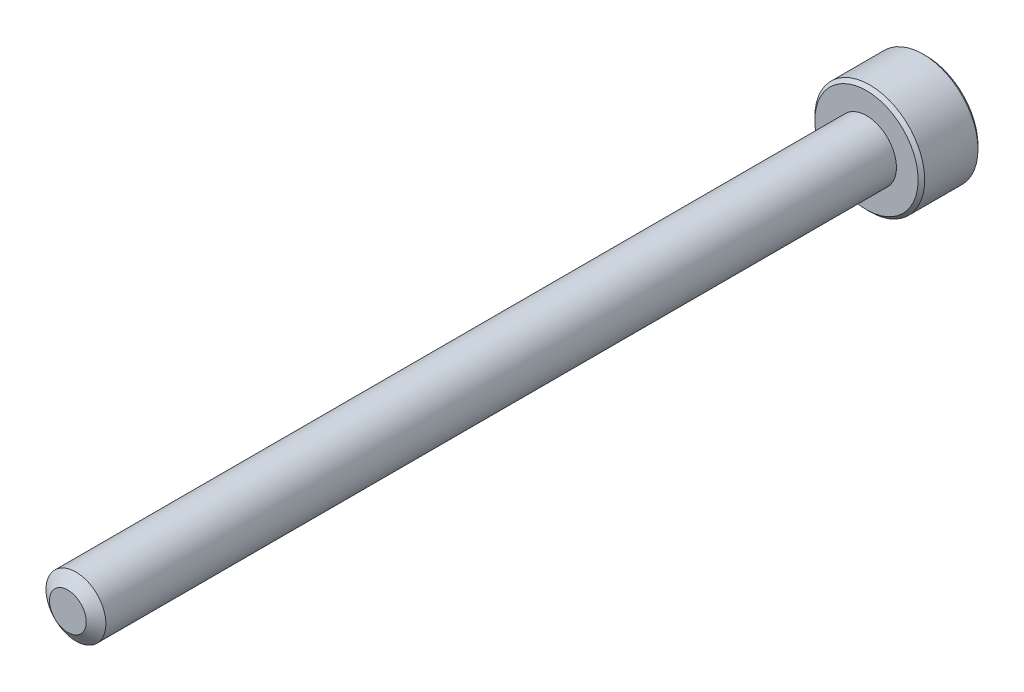
ISO-10303-21;
HEADER;
FILE_DESCRIPTION(('STEP AP214'),'2;1');
FILE_NAME('part.step','',(''),(''),'','','');
FILE_SCHEMA(('AUTOMOTIVE_DESIGN { 1 0 10303 214 1 1 1 1 }'));
ENDSEC;
DATA;
#1=APPLICATION_CONTEXT('core data for automotive mechanical design processes');
#2=APPLICATION_PROTOCOL_DEFINITION('international standard','automotive_design',2000,#1);
#3=PRODUCT_CONTEXT('',#1,'mechanical');
#4=PRODUCT('Part','Part','',(#3));
#5=PRODUCT_RELATED_PRODUCT_CATEGORY('part','',(#4));
#6=PRODUCT_DEFINITION_FORMATION('','',#4);
#7=PRODUCT_DEFINITION_CONTEXT('part definition',#1,'design');
#8=PRODUCT_DEFINITION('design','',#6,#7);
#9=PRODUCT_DEFINITION_SHAPE('','',#8);
#10=(LENGTH_UNIT() NAMED_UNIT(*) SI_UNIT(.MILLI.,.METRE.));
#11=(NAMED_UNIT(*) PLANE_ANGLE_UNIT() SI_UNIT($,.RADIAN.));
#12=(NAMED_UNIT(*) SI_UNIT($,.STERADIAN.) SOLID_ANGLE_UNIT());
#13=UNCERTAINTY_MEASURE_WITH_UNIT(LENGTH_MEASURE(1.E-05),#10,'distance_accuracy_value','');
#14=(GEOMETRIC_REPRESENTATION_CONTEXT(3) GLOBAL_UNCERTAINTY_ASSIGNED_CONTEXT((#13)) GLOBAL_UNIT_ASSIGNED_CONTEXT((#10,
#11,#12)) REPRESENTATION_CONTEXT('',''));
#15=CARTESIAN_POINT('',(0.,0.,0.));
#16=DIRECTION('',(0.,0.,1.));
#17=DIRECTION('',(1.,0.,0.));
#18=AXIS2_PLACEMENT_3D('',#15,#16,#17);
#19=CARTESIAN_POINT('',(0.,-1.44337567297406,-41.125));
#20=DIRECTION('',(-0.5,-0.866025403784439,0.));
#21=DIRECTION('',(0.866025403784439,-0.5,0.));
#22=AXIS2_PLACEMENT_3D('',#19,#20,#21);
#23=PLANE('',#22);
#24=CARTESIAN_POINT('',(-1.24999999999963,-0.721687836487239,-43.000000000003));
#25=CARTESIAN_POINT('',(-1.20703689149564,-0.746492598747242,-42.975219039721));
#26=CARTESIAN_POINT('',(-1.16335543595403,-0.771712098862788,-42.9518937494657));
#27=CARTESIAN_POINT('',(-1.07428446543638,-0.823137247668132,-42.909186138913));
#28=CARTESIAN_POINT('',(-1.02888648443507,-0.849347784219903,-42.8898275733521));
#29=CARTESIAN_POINT('',(-0.937343688522239,-0.902200042082549,-42.856666215906));
#30=CARTESIAN_POINT('',(-0.891222174141857,-0.928828310825495,-42.8427800967764));
#31=CARTESIAN_POINT('',(-0.797964038891722,-0.982670920316284,-42.8213859017929));
#32=CARTESIAN_POINT('',(-0.750830264934014,-1.00988361739869,-42.8138618619147));
#33=CARTESIAN_POINT('',(-0.669590913522165,-1.05678717880511,-42.8070728277893));
#34=CARTESIAN_POINT('',(-0.635590177984719,-1.0764175126203,-42.8060681886478));
#35=CARTESIAN_POINT('',(-0.567648554675726,-1.11564362712693,-42.8077634952143));
#36=CARTESIAN_POINT('',(-0.533707681782475,-1.13523939922838,-42.8104642592547));
#37=CARTESIAN_POINT('',(-0.466153619735967,-1.17424175513578,-42.819414248338));
#38=CARTESIAN_POINT('',(-0.432540764897634,-1.19364814592492,-42.8256667730503));
#39=CARTESIAN_POINT('',(-0.365876260757905,-1.23213691533539,-42.8413835392386));
#40=CARTESIAN_POINT('',(-0.332824858668716,-1.25121915122868,-42.8508491588515));
#41=CARTESIAN_POINT('',(-0.248213569935874,-1.30006950155507,-42.8789283315731));
#42=CARTESIAN_POINT('',(-0.197186124431756,-1.32953021095293,-42.8996493450566));
#43=CARTESIAN_POINT('',(-0.0971276056215303,-1.38729902372273,-42.9463235058126));
#44=CARTESIAN_POINT('',(-0.0480906425376808,-1.41561052755943,-42.9722596212246));
#45=CARTESIAN_POINT('',(-3.61828884321874E-13,-1.44337567297385,-43.000000000003));
#46=B_SPLINE_CURVE_WITH_KNOTS('',3,(#24,#25,#26,#27,#28,#29,#30,#31,#32,#33,#34,#35,#36,#37,#38,
#39,#40,#41,#42,#43,#44,#45),.UNSPECIFIED.,.F.,.F.,(4,2,2,2,2,2,2,2,2,2,4),(0.,0.16647868322575,
0.333926926832641,0.498716658518154,0.663091654628168,0.780745575560145,0.898425484353181,
1.01621489977196,1.13405490052613,1.32111591641517,1.50757565758526),.UNSPECIFIED.);
#47=CARTESIAN_POINT('',(-1.25000000000258,-0.721687836485538,-43.0000000000047));
#48=VERTEX_POINT('',#47);
#49=CARTESIAN_POINT('',(-2.76064978169122E-12,-1.44337567297566,-43.0000000000048));
#50=VERTEX_POINT('',#49);
#51=EDGE_CURVE('E21',#48,#50,#46,.T.);
#52=ORIENTED_EDGE('',*,*,#51,.F.);
#53=DIRECTION('',(0.,0.,1.));
#54=VECTOR('',#53,1.);
#55=CARTESIAN_POINT('',(-1.25,-0.721687836487032,-41.125));
#56=LINE('',#55,#54);
#57=CARTESIAN_POINT('',(-1.25,-0.721687836487031,-41.125));
#58=VERTEX_POINT('',#57);
#59=EDGE_CURVE('E104',#48,#58,#56,.T.);
#60=ORIENTED_EDGE('',*,*,#59,.T.);
#61=DIRECTION('',(0.866025403784439,-0.5,0.));
#62=VECTOR('',#61,1.);
#63=CARTESIAN_POINT('',(0.,-1.44337567297406,-41.125));
#64=LINE('',#63,#62);
#65=CARTESIAN_POINT('',(0.,-1.44337567297406,-41.125));
#66=VERTEX_POINT('',#65);
#67=EDGE_CURVE('E77',#66,#58,#64,.F.);
#68=ORIENTED_EDGE('',*,*,#67,.F.);
#69=DIRECTION('',(0.,0.,1.));
#70=VECTOR('',#69,1.);
#71=CARTESIAN_POINT('',(0.,-1.44337567297406,-41.125));
#72=LINE('',#71,#70);
#73=EDGE_CURVE('E76',#66,#50,#72,.F.);
#74=ORIENTED_EDGE('',*,*,#73,.T.);
#75=EDGE_LOOP('',(#52,#60,#68,#74));
#76=FACE_BOUND('',#75,.T.);
#77=ADVANCED_FACE('F17',(#76),#23,.F.);
#78=CARTESIAN_POINT('',(1.25,-0.721687836487033,-41.125));
#79=DIRECTION('',(0.5,-0.866025403784439,0.));
#80=DIRECTION('',(0.866025403784439,0.5,0.));
#81=AXIS2_PLACEMENT_3D('',#78,#79,#80);
#82=PLANE('',#81);
#83=CARTESIAN_POINT('',(3.65491355903534E-13,-1.44337567297385,-43.000000000003));
#84=CARTESIAN_POINT('',(0.042963108504357,-1.41857091071385,-42.975219039721));
#85=CARTESIAN_POINT('',(0.0866445640459731,-1.3933514105983,-42.9518937494657));
#86=CARTESIAN_POINT('',(0.175715534563619,-1.34192626179296,-42.909186138913));
#87=CARTESIAN_POINT('',(0.221113515564926,-1.31571572524119,-42.8898275733521));
#88=CARTESIAN_POINT('',(0.312656311477759,-1.26286346737855,-42.856666215906));
#89=CARTESIAN_POINT('',(0.35877782585814,-1.2362351986356,-42.8427800967764));
#90=CARTESIAN_POINT('',(0.452035961108275,-1.18239258914481,-42.8213859017929));
#91=CARTESIAN_POINT('',(0.499169735065983,-1.15517989206241,-42.8138618619147));
#92=CARTESIAN_POINT('',(0.580409086477832,-1.10827633065598,-42.8070728277893));
#93=CARTESIAN_POINT('',(0.614409822015277,-1.08864599684079,-42.8060681886478));
#94=CARTESIAN_POINT('',(0.68235144532427,-1.04941988233417,-42.8077634952143));
#95=CARTESIAN_POINT('',(0.716292318217521,-1.02982411023272,-42.8104642592547));
#96=CARTESIAN_POINT('',(0.783846380264029,-0.990821754325314,-42.819414248338));
#97=CARTESIAN_POINT('',(0.817459235102362,-0.971415363536171,-42.8256667730503));
#98=CARTESIAN_POINT('',(0.884123739242092,-0.932926594125705,-42.8413835392386));
#99=CARTESIAN_POINT('',(0.917175141331281,-0.913844358232417,-42.8508491588515));
#100=CARTESIAN_POINT('',(1.00178643006412,-0.86499400790603,-42.8789283315731));
#101=CARTESIAN_POINT('',(1.05281387556824,-0.835533298508169,-42.8996493450566));
#102=CARTESIAN_POINT('',(1.15287239437847,-0.77776448573837,-42.9463235058126));
#103=CARTESIAN_POINT('',(1.20190935746232,-0.749452981901667,-42.9722596212246));
#104=CARTESIAN_POINT('',(1.24999999999963,-0.721687836487244,-43.000000000003));
#105=B_SPLINE_CURVE_WITH_KNOTS('',3,(#83,#84,#85,#86,#87,#88,#89,#90,#91,#92,#93,#94,#95,#96,
#97,#98,#99,#100,#101,#102,#103,#104),.UNSPECIFIED.,.F.,.F.,(4,2,2,2,2,2,2,2,2,2,4),(0.,
0.166478683225751,0.333926926832639,0.498716658518151,0.663091654628164,0.780745575560141,
0.898425484353177,1.01621489977195,1.13405490052613,1.32111591641516,1.50757565758525),.UNSPECIFIED.);
#106=CARTESIAN_POINT('',(1.25,-0.721687836490222,-43.0000000000048));
#107=VERTEX_POINT('',#106);
#108=EDGE_CURVE('E84',#50,#107,#105,.T.);
#109=ORIENTED_EDGE('',*,*,#108,.F.);
#110=ORIENTED_EDGE('',*,*,#73,.F.);
#111=DIRECTION('',(-0.86602540378444,-0.499999999999997,0.));
#112=VECTOR('',#111,1.);
#113=CARTESIAN_POINT('',(1.25,-0.721687836487033,-41.125));
#114=LINE('',#113,#112);
#115=CARTESIAN_POINT('',(1.25,-0.721687836487033,-41.125));
#116=VERTEX_POINT('',#115);
#117=EDGE_CURVE('E272',#116,#66,#114,.T.);
#118=ORIENTED_EDGE('',*,*,#117,.F.);
#119=DIRECTION('',(0.,0.,-1.));
#120=VECTOR('',#119,1.);
#121=CARTESIAN_POINT('',(1.25,-0.721687836487033,-41.125));
#122=LINE('',#121,#120);
#123=EDGE_CURVE('E103',#116,#107,#122,.T.);
#124=ORIENTED_EDGE('',*,*,#123,.T.);
#125=EDGE_LOOP('',(#109,#110,#118,#124));
#126=FACE_BOUND('',#125,.T.);
#127=ADVANCED_FACE('F101',(#126),#82,.F.);
#128=CARTESIAN_POINT('',(-1.25,-0.721687836487032,-41.125));
#129=DIRECTION('',(-1.,0.,0.));
#130=DIRECTION('',(0.,-1.,0.));
#131=AXIS2_PLACEMENT_3D('',#128,#129,#130);
#132=PLANE('',#131);
#133=CARTESIAN_POINT('',(-1.25,0.72168783648661,-43.000000000003));
#134=CARTESIAN_POINT('',(-1.25,0.672078311966606,-42.975219039721));
#135=CARTESIAN_POINT('',(-1.25,0.621639311735512,-42.9518937494657));
#136=CARTESIAN_POINT('',(-1.25,0.518789014124825,-42.909186138913));
#137=CARTESIAN_POINT('',(-1.25,0.466367941021285,-42.8898275733521));
#138=CARTESIAN_POINT('',(-1.25,0.360663425295995,-42.856666215906));
#139=CARTESIAN_POINT('',(-1.25,0.307406887810102,-42.8427800967764));
#140=CARTESIAN_POINT('',(-1.25,0.199721668828528,-42.8213859017929));
#141=CARTESIAN_POINT('',(-1.25,0.145296274663717,-42.8138618619147));
#142=CARTESIAN_POINT('',(-1.25,0.0514891518508746,-42.8070728277893));
#143=CARTESIAN_POINT('',(-1.25,0.0122284842204953,-42.8060681886478));
#144=CARTESIAN_POINT('',(-1.25,-0.0662237447927591,-42.8077634952143));
#145=CARTESIAN_POINT('',(-1.25,-0.105415288995657,-42.8104642592547));
#146=CARTESIAN_POINT('',(-1.25,-0.183420000810465,-42.819414248338));
#147=CARTESIAN_POINT('',(-1.25,-0.222232782388752,-42.8256667730503));
#148=CARTESIAN_POINT('',(-1.25,-0.299210321209684,-42.8413835392386));
#149=CARTESIAN_POINT('',(-1.25,-0.33737479299626,-42.8508491588515));
#150=CARTESIAN_POINT('',(-1.25,-0.435075493649035,-42.8789283315731));
#151=CARTESIAN_POINT('',(-1.25,-0.493996912444758,-42.8996493450566));
#152=CARTESIAN_POINT('',(-1.25,-0.609534537984357,-42.9463235058126));
#153=CARTESIAN_POINT('',(-1.25,-0.666157545657763,-42.9722596212246));
#154=CARTESIAN_POINT('',(-1.25,-0.72168783648661,-43.000000000003));
#155=B_SPLINE_CURVE_WITH_KNOTS('',3,(#133,#134,#135,#136,#137,#138,#139,#140,#141,#142,#143,
#144,#145,#146,#147,#148,#149,#150,#151,#152,#153,#154),.UNSPECIFIED.,.F.,.F.,(4,2,2,2,2,2,2,2,
2,2,4),(0.,0.16647868322575,0.333926926832637,0.498716658518149,0.66309165462816,
0.780745575560138,0.898425484353173,1.01621489977195,1.13405490052612,1.32111591641516,
1.50757565758525),.UNSPECIFIED.);
#156=CARTESIAN_POINT('',(-1.25,0.721687836490011,-43.0000000000047));
#157=VERTEX_POINT('',#156);
#158=EDGE_CURVE('E61',#157,#48,#155,.T.);
#159=ORIENTED_EDGE('',*,*,#158,.F.);
#160=DIRECTION('',(0.,0.,1.));
#161=VECTOR('',#160,1.);
#162=CARTESIAN_POINT('',(-1.25,0.721687836487032,-41.125));
#163=LINE('',#162,#161);
#164=CARTESIAN_POINT('',(-1.25,0.721687836487032,-41.125));
#165=VERTEX_POINT('',#164);
#166=EDGE_CURVE('E249',#157,#165,#163,.T.);
#167=ORIENTED_EDGE('',*,*,#166,.T.);
#168=DIRECTION('',(0.,1.,0.));
#169=VECTOR('',#168,1.);
#170=CARTESIAN_POINT('',(-1.25,2.1650635094611,-41.125));
#171=LINE('',#170,#169);
#172=EDGE_CURVE('E268',#58,#165,#171,.T.);
#173=ORIENTED_EDGE('',*,*,#172,.F.);
#174=ORIENTED_EDGE('',*,*,#59,.F.);
#175=EDGE_LOOP('',(#159,#167,#173,#174));
#176=FACE_BOUND('',#175,.T.);
#177=ADVANCED_FACE('F122',(#176),#132,.F.);
#178=CARTESIAN_POINT('',(1.25,2.1650635094611,-41.125));
#179=DIRECTION('',(0.,0.,-1.));
#180=DIRECTION('',(-1.,0.,0.));
#181=AXIS2_PLACEMENT_3D('',#178,#179,#180);
#182=PLANE('',#181);
#183=ORIENTED_EDGE('',*,*,#67,.T.);
#184=ORIENTED_EDGE('',*,*,#172,.T.);
#185=DIRECTION('',(-0.866025403784439,-0.5,0.));
#186=VECTOR('',#185,1.);
#187=CARTESIAN_POINT('',(-1.25,0.721687836487032,-41.125));
#188=LINE('',#187,#186);
#189=CARTESIAN_POINT('',(0.,1.44337567297406,-41.125));
#190=VERTEX_POINT('',#189);
#191=EDGE_CURVE('E144',#165,#190,#188,.F.);
#192=ORIENTED_EDGE('',*,*,#191,.T.);
#193=DIRECTION('',(-0.866025403784439,0.5,0.));
#194=VECTOR('',#193,1.);
#195=CARTESIAN_POINT('',(0.,1.44337567297406,-41.125));
#196=LINE('',#195,#194);
#197=CARTESIAN_POINT('',(1.25,0.721687836487029,-41.125));
#198=VERTEX_POINT('',#197);
#199=EDGE_CURVE('E246',#190,#198,#196,.F.);
#200=ORIENTED_EDGE('',*,*,#199,.T.);
#201=DIRECTION('',(0.,1.,0.));
#202=VECTOR('',#201,1.);
#203=CARTESIAN_POINT('',(1.25,0.721687836487032,-41.125));
#204=LINE('',#203,#202);
#205=EDGE_CURVE('E263',#198,#116,#204,.F.);
#206=ORIENTED_EDGE('',*,*,#205,.T.);
#207=ORIENTED_EDGE('',*,*,#117,.T.);
#208=EDGE_LOOP('',(#183,#184,#192,#200,#206,#207));
#209=FACE_BOUND('',#208,.T.);
#210=ADVANCED_FACE('F126',(#209),#182,.T.);
#211=CARTESIAN_POINT('',(1.25,0.721687836487032,-41.125));
#212=DIRECTION('',(1.,0.,0.));
#213=DIRECTION('',(0.,0.,-1.));
#214=AXIS2_PLACEMENT_3D('',#211,#212,#213);
#215=PLANE('',#214);
#216=CARTESIAN_POINT('',(1.25,-0.72168783648661,-43.000000000003));
#217=CARTESIAN_POINT('',(1.25,-0.672078311966609,-42.975219039721));
#218=CARTESIAN_POINT('',(1.25,-0.621639311735518,-42.9518937494657));
#219=CARTESIAN_POINT('',(1.25,-0.518789014124834,-42.909186138913));
#220=CARTESIAN_POINT('',(1.25,-0.466367941021294,-42.8898275733521));
#221=CARTESIAN_POINT('',(1.25,-0.360663425296003,-42.856666215906));
#222=CARTESIAN_POINT('',(1.25,-0.307406887810109,-42.8427800967764));
#223=CARTESIAN_POINT('',(1.25,-0.199721668828531,-42.8213859017929));
#224=CARTESIAN_POINT('',(1.25,-0.145296274663719,-42.8138618619147));
#225=CARTESIAN_POINT('',(1.25,-0.051489151850874,-42.8070728277893));
#226=CARTESIAN_POINT('',(1.25,-0.012228484220494,-42.8060681886478));
#227=CARTESIAN_POINT('',(1.25,0.0662237447927618,-42.8077634952143));
#228=CARTESIAN_POINT('',(1.25,0.105415288995661,-42.8104642592547));
#229=CARTESIAN_POINT('',(1.25,0.183420000810469,-42.819414248338));
#230=CARTESIAN_POINT('',(1.25,0.222232782388755,-42.8256667730503));
#231=CARTESIAN_POINT('',(1.25,0.299210321209685,-42.8413835392386));
#232=CARTESIAN_POINT('',(1.25,0.33737479299626,-42.8508491588515));
#233=CARTESIAN_POINT('',(1.25,0.435075493648657,-42.878928331573));
#234=CARTESIAN_POINT('',(1.25,0.493996912444016,-42.8996493450564));
#235=CARTESIAN_POINT('',(1.25,0.609534537982913,-42.9463235058119));
#236=CARTESIAN_POINT('',(1.25,0.666157545655982,-42.9722596212237));
#237=CARTESIAN_POINT('',(1.25,0.721687836484505,-43.0000000000019));
#238=B_SPLINE_CURVE_WITH_KNOTS('',3,(#216,#217,#218,#219,#220,#221,#222,#223,#224,#225,#226,
#227,#228,#229,#230,#231,#232,#233,#234,#235,#236,#237),.UNSPECIFIED.,.F.,.F.,(4,2,2,2,2,2,2,2,
2,2,4),(0.,0.166478683225743,0.333926926832625,0.498716658518143,0.663091654628159,
0.780745575560139,0.898425484353176,1.01621489977195,1.13405490052612,1.32111591641398,
1.5075756575829),.UNSPECIFIED.);
#239=CARTESIAN_POINT('',(1.25000000000029,0.721687836488459,-43.0000000000041));
#240=VERTEX_POINT('',#239);
#241=EDGE_CURVE('E40',#107,#240,#238,.T.);
#242=ORIENTED_EDGE('',*,*,#241,.F.);
#243=ORIENTED_EDGE('',*,*,#123,.F.);
#244=ORIENTED_EDGE('',*,*,#205,.F.);
#245=DIRECTION('',(0.,0.,1.));
#246=VECTOR('',#245,1.);
#247=CARTESIAN_POINT('',(1.25,0.721687836487029,-41.125));
#248=LINE('',#247,#246);
#249=EDGE_CURVE('E242',#198,#240,#248,.F.);
#250=ORIENTED_EDGE('',*,*,#249,.T.);
#251=EDGE_LOOP('',(#242,#243,#244,#250));
#252=FACE_BOUND('',#251,.T.);
#253=ADVANCED_FACE('F130',(#252),#215,.F.);
#254=CARTESIAN_POINT('',(-1.25,0.721687836487032,-41.125));
#255=DIRECTION('',(-0.5,0.866025403784439,0.));
#256=DIRECTION('',(-0.866025403784439,-0.5,0.));
#257=AXIS2_PLACEMENT_3D('',#254,#255,#256);
#258=PLANE('',#257);
#259=CARTESIAN_POINT('',(-2.18591770066846E-12,1.4433756729728,-43.0000000000019));
#260=CARTESIAN_POINT('',(-0.0429631085060691,1.41857091071286,-42.9752190397201));
#261=CARTESIAN_POINT('',(-0.086644564047575,1.39335141059738,-42.9518937494649));
#262=CARTESIAN_POINT('',(-0.175715534564988,1.34192626179217,-42.9091861389124));
#263=CARTESIAN_POINT('',(-0.221113515566174,1.31571572524047,-42.8898275733516));
#264=CARTESIAN_POINT('',(-0.312656311478756,1.26286346737797,-42.8566662159057));
#265=CARTESIAN_POINT('',(-0.358777825859009,1.2362351986351,-42.8427800967762));
#266=CARTESIAN_POINT('',(-0.452035961108879,1.18239258914446,-42.8213859017928));
#267=CARTESIAN_POINT('',(-0.49916973506645,1.15517989206214,-42.8138618619146));
#268=CARTESIAN_POINT('',(-0.580409086478155,1.1082763306558,-42.8070728277893));
#269=CARTESIAN_POINT('',(-0.614409822015595,1.08864599684061,-42.8060681886478));
#270=CARTESIAN_POINT('',(-0.682351445324575,1.04941988233399,-42.8077634952143));
#271=CARTESIAN_POINT('',(-0.716292318217819,1.02982411023254,-42.8104642592547));
#272=CARTESIAN_POINT('',(-0.783846380264314,0.990821754325149,-42.819414248338));
#273=CARTESIAN_POINT('',(-0.81745923510264,0.971415363536009,-42.8256667730504));
#274=CARTESIAN_POINT('',(-0.884123739242356,0.932926594125552,-42.8413835392387));
#275=CARTESIAN_POINT('',(-0.917175141331538,0.913844358232268,-42.8508491588516));
#276=CARTESIAN_POINT('',(-1.00178643006433,0.86499400790591,-42.8789283315732));
#277=CARTESIAN_POINT('',(-1.0528138755684,0.835533298508073,-42.8996493450567));
#278=CARTESIAN_POINT('',(-1.15287239437855,0.777764485738322,-42.9463235058126));
#279=CARTESIAN_POINT('',(-1.20190935746236,0.749452981901643,-42.9722596212246));
#280=CARTESIAN_POINT('',(-1.24999999999963,0.721687836487243,-43.000000000003));
#281=B_SPLINE_CURVE_WITH_KNOTS('',3,(#259,#260,#261,#262,#263,#264,#265,#266,#267,#268,#269,
#270,#271,#272,#273,#274,#275,#276,#277,#278,#279,#280),.UNSPECIFIED.,.F.,.F.,(4,2,2,2,2,2,2,2,
2,2,4),(0.,0.16647868322526,0.333926926831642,0.498716658516666,0.663091654626194,
0.780745575558151,0.898425484351165,1.01621489976992,1.13405490052408,1.32111591641297,
1.5075756575829),.UNSPECIFIED.);
#282=CARTESIAN_POINT('',(-1.67429437889982E-12,1.44337567297503,-43.0000000000041));
#283=VERTEX_POINT('',#282);
#284=EDGE_CURVE('E145',#283,#157,#281,.T.);
#285=ORIENTED_EDGE('',*,*,#284,.F.);
#286=DIRECTION('',(0.,0.,1.));
#287=VECTOR('',#286,1.);
#288=CARTESIAN_POINT('',(0.,1.44337567297406,-41.125));
#289=LINE('',#288,#287);
#290=EDGE_CURVE('E170',#283,#190,#289,.T.);
#291=ORIENTED_EDGE('',*,*,#290,.T.);
#292=ORIENTED_EDGE('',*,*,#191,.F.);
#293=ORIENTED_EDGE('',*,*,#166,.F.);
#294=EDGE_LOOP('',(#285,#291,#292,#293));
#295=FACE_BOUND('',#294,.T.);
#296=ADVANCED_FACE('F135',(#295),#258,.F.);
#297=CARTESIAN_POINT('',(0.,1.44337567297406,-41.125));
#298=DIRECTION('',(0.5,0.866025403784439,0.));
#299=DIRECTION('',(-0.866025403784439,0.5,0.));
#300=AXIS2_PLACEMENT_3D('',#297,#298,#299);
#301=PLANE('',#300);
#302=CARTESIAN_POINT('',(2.18308492987564E-12,1.4433756729728,-43.0000000000019));
#303=CARTESIAN_POINT('',(0.0429631085060646,1.41857091071286,-42.9752190397201));
#304=CARTESIAN_POINT('',(0.0866445640475686,1.39335141059738,-42.9518937494649));
#305=CARTESIAN_POINT('',(0.175715534564978,1.34192626179217,-42.9091861389124));
#306=CARTESIAN_POINT('',(0.221113515566162,1.31571572524047,-42.8898275733516));
#307=CARTESIAN_POINT('',(0.312656311478745,1.26286346737797,-42.8566662159057));
#308=CARTESIAN_POINT('',(0.358777825859,1.2362351986351,-42.8427800967762));
#309=CARTESIAN_POINT('',(0.452035961108874,1.18239258914446,-42.8213859017928));
#310=CARTESIAN_POINT('',(0.499169735066448,1.15517989206213,-42.8138618619146));
#311=CARTESIAN_POINT('',(0.580409086478155,1.10827633065579,-42.8070728277893));
#312=CARTESIAN_POINT('',(0.614409822015596,1.08864599684061,-42.8060681886478));
#313=CARTESIAN_POINT('',(0.682351445324577,1.04941988233399,-42.8077634952143));
#314=CARTESIAN_POINT('',(0.716292318217822,1.02982411023254,-42.8104642592547));
#315=CARTESIAN_POINT('',(0.783846380264316,0.990821754325144,-42.819414248338));
#316=CARTESIAN_POINT('',(0.817459235102642,0.971415363536004,-42.8256667730504));
#317=CARTESIAN_POINT('',(0.884123739242357,0.932926594125547,-42.8413835392387));
#318=CARTESIAN_POINT('',(0.917175141331538,0.913844358232264,-42.8508491588516));
#319=CARTESIAN_POINT('',(1.001786430064,0.864994007906095,-42.8789283315731));
#320=CARTESIAN_POINT('',(1.05281387556776,0.835533298508441,-42.8996493450564));
#321=CARTESIAN_POINT('',(1.15287239437729,0.777764485739041,-42.946323505812));
#322=CARTESIAN_POINT('',(1.20190935746081,0.749452981902531,-42.9722596212238));
#323=CARTESIAN_POINT('',(1.24999999999781,0.721687836488291,-43.0000000000019));
#324=B_SPLINE_CURVE_WITH_KNOTS('',3,(#302,#303,#304,#305,#306,#307,#308,#309,#310,#311,#312,
#313,#314,#315,#316,#317,#318,#319,#320,#321,#322,#323),.UNSPECIFIED.,.F.,.F.,(4,2,2,2,2,2,2,2,
2,2,4),(0.,0.166478683225254,0.333926926831631,0.498716658516661,0.663091654626198,
0.780745575558156,0.898425484351172,1.01621489976993,1.13405490052408,1.32111591641179,
1.50757565758056),.UNSPECIFIED.);
#325=EDGE_CURVE('E162',#283,#240,#324,.T.);
#326=ORIENTED_EDGE('',*,*,#325,.T.);
#327=ORIENTED_EDGE('',*,*,#249,.F.);
#328=ORIENTED_EDGE('',*,*,#199,.F.);
#329=ORIENTED_EDGE('',*,*,#290,.F.);
#330=EDGE_LOOP('',(#326,#327,#328,#329));
#331=FACE_BOUND('',#330,.T.);
#332=ADVANCED_FACE('F172',(#331),#301,.F.);
#333=CARTESIAN_POINT('',(0.,0.,-42.9999999998927));
#334=DIRECTION('',(0.,0.,-1.));
#335=DIRECTION('',(-1.,0.,0.));
#336=AXIS2_PLACEMENT_3D('',#333,#334,#335);
#337=CONICAL_SURFACE('',#336,1.44337567286357,0.785398163397448);
#338=ORIENTED_EDGE('',*,*,#284,.T.);
#339=CARTESIAN_POINT('',(0.,0.,-43.0000000000064));
#340=DIRECTION('',(0.,0.,-1.));
#341=DIRECTION('',(-1.,0.,0.));
#342=AXIS2_PLACEMENT_3D('',#339,#340,#341);
#343=CIRCLE('',#342,1.44337567297725);
#344=EDGE_CURVE('E169',#283,#157,#343,.F.);
#345=ORIENTED_EDGE('',*,*,#344,.F.);
#346=EDGE_LOOP('',(#338,#345));
#347=FACE_BOUND('',#346,.T.);
#348=ADVANCED_FACE('F175',(#347),#337,.F.);
#349=CARTESIAN_POINT('',(0.,0.,-42.9999999998927));
#350=DIRECTION('',(0.,0.,-1.));
#351=DIRECTION('',(-1.,0.,0.));
#352=AXIS2_PLACEMENT_3D('',#349,#350,#351);
#353=CONICAL_SURFACE('',#352,1.44337567286357,0.785398163397448);
#354=CARTESIAN_POINT('',(0.,0.,-43.0000000000064));
#355=DIRECTION('',(0.,0.,-1.));
#356=DIRECTION('',(-1.,0.,0.));
#357=AXIS2_PLACEMENT_3D('',#354,#355,#356);
#358=CIRCLE('',#357,1.44337567297725);
#359=EDGE_CURVE('E94',#157,#48,#358,.F.);
#360=ORIENTED_EDGE('',*,*,#359,.F.);
#361=ORIENTED_EDGE('',*,*,#158,.T.);
#362=EDGE_LOOP('',(#360,#361));
#363=FACE_BOUND('',#362,.T.);
#364=ADVANCED_FACE('F179',(#363),#353,.F.);
#365=CARTESIAN_POINT('',(0.,0.,-42.9999999998927));
#366=DIRECTION('',(0.,0.,-1.));
#367=DIRECTION('',(-1.,0.,0.));
#368=AXIS2_PLACEMENT_3D('',#365,#366,#367);
#369=CONICAL_SURFACE('',#368,1.44337567286357,0.785398163397448);
#370=ORIENTED_EDGE('',*,*,#51,.T.);
#371=CARTESIAN_POINT('',(0.,0.,-43.0000000000064));
#372=DIRECTION('',(0.,0.,-1.));
#373=DIRECTION('',(-1.,0.,0.));
#374=AXIS2_PLACEMENT_3D('',#371,#372,#373);
#375=CIRCLE('',#374,1.44337567297725);
#376=EDGE_CURVE('E72',#48,#50,#375,.F.);
#377=ORIENTED_EDGE('',*,*,#376,.F.);
#378=EDGE_LOOP('',(#370,#377));
#379=FACE_BOUND('',#378,.T.);
#380=ADVANCED_FACE('F70',(#379),#369,.F.);
#381=CARTESIAN_POINT('',(0.,0.,-42.9999999998927));
#382=DIRECTION('',(0.,0.,-1.));
#383=DIRECTION('',(-1.,0.,0.));
#384=AXIS2_PLACEMENT_3D('',#381,#382,#383);
#385=CONICAL_SURFACE('',#384,1.44337567286357,0.785398163397448);
#386=ORIENTED_EDGE('',*,*,#108,.T.);
#387=CARTESIAN_POINT('',(0.,0.,-43.0000000000064));
#388=DIRECTION('',(0.,0.,-1.));
#389=DIRECTION('',(-1.,0.,0.));
#390=AXIS2_PLACEMENT_3D('',#387,#388,#389);
#391=CIRCLE('',#390,1.44337567297725);
#392=EDGE_CURVE('E92',#50,#107,#391,.F.);
#393=ORIENTED_EDGE('',*,*,#392,.F.);
#394=EDGE_LOOP('',(#386,#393));
#395=FACE_BOUND('',#394,.T.);
#396=ADVANCED_FACE('F97',(#395),#385,.F.);
#397=CARTESIAN_POINT('',(0.,0.,-42.9999999998927));
#398=DIRECTION('',(0.,0.,-1.));
#399=DIRECTION('',(-1.,0.,0.));
#400=AXIS2_PLACEMENT_3D('',#397,#398,#399);
#401=CONICAL_SURFACE('',#400,1.44337567286357,0.785398163397448);
#402=ORIENTED_EDGE('',*,*,#241,.T.);
#403=CARTESIAN_POINT('',(0.,0.,-43.0000000000064));
#404=DIRECTION('',(0.,0.,-1.));
#405=DIRECTION('',(-1.,0.,0.));
#406=AXIS2_PLACEMENT_3D('',#403,#404,#405);
#407=CIRCLE('',#406,1.44337567297725);
#408=EDGE_CURVE('E99',#107,#240,#407,.F.);
#409=ORIENTED_EDGE('',*,*,#408,.F.);
#410=EDGE_LOOP('',(#402,#409));
#411=FACE_BOUND('',#410,.T.);
#412=ADVANCED_FACE('F152',(#411),#401,.F.);
#413=CARTESIAN_POINT('',(0.,0.,-42.9999999998927));
#414=DIRECTION('',(0.,0.,-1.));
#415=DIRECTION('',(-1.,0.,0.));
#416=AXIS2_PLACEMENT_3D('',#413,#414,#415);
#417=CONICAL_SURFACE('',#416,1.44337567286357,0.785398163397448);
#418=ORIENTED_EDGE('',*,*,#325,.F.);
#419=CARTESIAN_POINT('',(0.,0.,-43.0000000000064));
#420=DIRECTION('',(0.,0.,-1.));
#421=DIRECTION('',(-1.,0.,0.));
#422=AXIS2_PLACEMENT_3D('',#419,#420,#421);
#423=CIRCLE('',#422,1.44337567297725);
#424=EDGE_CURVE('E234',#240,#283,#423,.F.);
#425=ORIENTED_EDGE('',*,*,#424,.F.);
#426=EDGE_LOOP('',(#418,#425));
#427=FACE_BOUND('',#426,.T.);
#428=ADVANCED_FACE('F156',(#427),#417,.F.);
#429=CARTESIAN_POINT('',(0.,0.,-43.));
#430=DIRECTION('',(0.,0.,-1.));
#431=DIRECTION('',(-1.,0.,0.));
#432=AXIS2_PLACEMENT_3D('',#429,#430,#431);
#433=PLANE('',#432);
#434=ORIENTED_EDGE('',*,*,#408,.T.);
#435=ORIENTED_EDGE('',*,*,#424,.T.);
#436=ORIENTED_EDGE('',*,*,#344,.T.);
#437=ORIENTED_EDGE('',*,*,#359,.T.);
#438=ORIENTED_EDGE('',*,*,#376,.T.);
#439=ORIENTED_EDGE('',*,*,#392,.T.);
#440=EDGE_LOOP('',(#434,#435,#436,#437,#438,#439));
#441=FACE_BOUND('',#440,.T.);
#442=CARTESIAN_POINT('',(0.,0.,-43.0000000000064));
#443=DIRECTION('',(0.,0.,1.));
#444=DIRECTION('',(1.,0.,0.));
#445=AXIS2_PLACEMENT_3D('',#442,#443,#444);
#446=CIRCLE('',#445,2.58500000006734);
#447=CARTESIAN_POINT('',(2.58500000006734,0.,-43.0000000000064));
#448=VERTEX_POINT('',#447);
#449=EDGE_CURVE('E225',#448,#448,#446,.T.);
#450=ORIENTED_EDGE('',*,*,#449,.F.);
#451=EDGE_LOOP('',(#450));
#452=FACE_BOUND('',#451,.T.);
#453=ADVANCED_FACE('F90',(#441,#452),#433,.T.);
#454=CARTESIAN_POINT('',(0.,0.,-42.835000000025));
#455=DIRECTION('',(0.,0.,1.));
#456=DIRECTION('',(1.,0.,0.));
#457=AXIS2_PLACEMENT_3D('',#454,#455,#456);
#458=CONICAL_SURFACE('',#457,2.75000000004866,0.785398163397448);
#459=ORIENTED_EDGE('',*,*,#449,.T.);
#460=EDGE_LOOP('',(#459));
#461=FACE_BOUND('',#460,.T.);
#462=CARTESIAN_POINT('',(0.,0.,-42.835));
#463=DIRECTION('',(0.,0.,1.));
#464=DIRECTION('',(1.,0.,0.));
#465=AXIS2_PLACEMENT_3D('',#462,#463,#464);
#466=CIRCLE('',#465,2.75);
#467=CARTESIAN_POINT('',(2.75,0.,-42.835));
#468=VERTEX_POINT('',#467);
#469=EDGE_CURVE('E228',#468,#468,#466,.T.);
#470=ORIENTED_EDGE('',*,*,#469,.F.);
#471=EDGE_LOOP('',(#470));
#472=FACE_BOUND('',#471,.T.);
#473=ADVANCED_FACE('F215',(#461,#472),#458,.T.);
#474=CARTESIAN_POINT('',(0.,0.,-43.));
#475=DIRECTION('',(0.,0.,1.));
#476=DIRECTION('',(1.,0.,0.));
#477=AXIS2_PLACEMENT_3D('',#474,#475,#476);
#478=CYLINDRICAL_SURFACE('',#477,2.75);
#479=ORIENTED_EDGE('',*,*,#469,.T.);
#480=EDGE_LOOP('',(#479));
#481=FACE_BOUND('',#480,.T.);
#482=CARTESIAN_POINT('',(0.,0.,-40.1649999999449));
#483=DIRECTION('',(0.,0.,-1.));
#484=DIRECTION('',(-1.,0.,0.));
#485=AXIS2_PLACEMENT_3D('',#482,#483,#484);
#486=CIRCLE('',#485,2.74999999999181);
#487=CARTESIAN_POINT('',(-2.74999999999181,0.,-40.1649999999449));
#488=VERTEX_POINT('',#487);
#489=EDGE_CURVE('E229',#488,#488,#486,.F.);
#490=ORIENTED_EDGE('',*,*,#489,.F.);
#491=EDGE_LOOP('',(#490));
#492=FACE_BOUND('',#491,.T.);
#493=ADVANCED_FACE('F212',(#481,#492),#478,.T.);
#494=CARTESIAN_POINT('',(0.,0.,0.));
#495=DIRECTION('',(0.,0.,1.));
#496=DIRECTION('',(1.,0.,0.));
#497=AXIS2_PLACEMENT_3D('',#494,#495,#496);
#498=PLANE('',#497);
#499=CARTESIAN_POINT('',(0.,0.,5.6843418860808E-11));
#500=DIRECTION('',(0.,0.,-1.));
#501=DIRECTION('',(-1.,0.,0.));
#502=AXIS2_PLACEMENT_3D('',#499,#500,#501);
#503=CIRCLE('',#502,0.921240473587659);
#504=CARTESIAN_POINT('',(-0.921240473587659,0.,5.6843418860808E-11));
#505=VERTEX_POINT('',#504);
#506=EDGE_CURVE('E232',#505,#505,#503,.T.);
#507=ORIENTED_EDGE('',*,*,#506,.F.);
#508=EDGE_LOOP('',(#507));
#509=FACE_BOUND('',#508,.T.);
#510=ADVANCED_FACE('F208',(#509),#498,.T.);
#511=CARTESIAN_POINT('',(0.,0.,-40.1649999998881));
#512=DIRECTION('',(0.,0.,-1.));
#513=DIRECTION('',(-1.,0.,0.));
#514=AXIS2_PLACEMENT_3D('',#511,#512,#513);
#515=CONICAL_SURFACE('',#514,2.74999999987813,0.785398163397448);
#516=CARTESIAN_POINT('',(0.,0.,-39.9999999999636));
#517=DIRECTION('',(0.,0.,-1.));
#518=DIRECTION('',(-1.,0.,0.));
#519=AXIS2_PLACEMENT_3D('',#516,#517,#518);
#520=CIRCLE('',#519,2.58499999995365);
#521=CARTESIAN_POINT('',(-2.58499999995365,0.,-39.9999999999636));
#522=VERTEX_POINT('',#521);
#523=EDGE_CURVE('E287',#522,#522,#520,.T.);
#524=ORIENTED_EDGE('',*,*,#523,.T.);
#525=EDGE_LOOP('',(#524));
#526=FACE_BOUND('',#525,.T.);
#527=ORIENTED_EDGE('',*,*,#489,.T.);
#528=EDGE_LOOP('',(#527));
#529=FACE_BOUND('',#528,.T.);
#530=ADVANCED_FACE('F204',(#526,#529),#515,.T.);
#531=CARTESIAN_POINT('',(0.,0.,-0.405251783149652));
#532=DIRECTION('',(0.,0.,-1.));
#533=DIRECTION('',(-1.,0.,0.));
#534=AXIS2_PLACEMENT_3D('',#531,#532,#533);
#535=CONICAL_SURFACE('',#534,1.50000000002137,0.959931088612039);
#536=ORIENTED_EDGE('',*,*,#506,.T.);
#537=EDGE_LOOP('',(#536));
#538=FACE_BOUND('',#537,.T.);
#539=CARTESIAN_POINT('',(0.,0.,-0.405251783209382));
#540=DIRECTION('',(0.,0.,1.));
#541=DIRECTION('',(1.,0.,0.));
#542=AXIS2_PLACEMENT_3D('',#539,#540,#541);
#543=CIRCLE('',#542,1.5);
#544=CARTESIAN_POINT('',(1.5,0.,-0.405251783209382));
#545=VERTEX_POINT('',#544);
#546=EDGE_CURVE('E32',#545,#545,#543,.F.);
#547=ORIENTED_EDGE('',*,*,#546,.F.);
#548=EDGE_LOOP('',(#547));
#549=FACE_BOUND('',#548,.T.);
#550=ADVANCED_FACE('F197',(#538,#549),#535,.T.);
#551=CARTESIAN_POINT('',(0.,0.,-40.));
#552=DIRECTION('',(0.,0.,-1.));
#553=DIRECTION('',(-1.,0.,0.));
#554=AXIS2_PLACEMENT_3D('',#551,#552,#553);
#555=PLANE('',#554);
#556=CARTESIAN_POINT('',(0.,0.,-40.));
#557=DIRECTION('',(0.,0.,1.));
#558=DIRECTION('',(1.,0.,0.));
#559=AXIS2_PLACEMENT_3D('',#556,#557,#558);
#560=CIRCLE('',#559,1.5);
#561=CARTESIAN_POINT('',(1.5,0.,-40.));
#562=VERTEX_POINT('',#561);
#563=EDGE_CURVE('E11',#562,#562,#560,.T.);
#564=ORIENTED_EDGE('',*,*,#563,.F.);
#565=EDGE_LOOP('',(#564));
#566=FACE_BOUND('',#565,.T.);
#567=ORIENTED_EDGE('',*,*,#523,.F.);
#568=EDGE_LOOP('',(#567));
#569=FACE_BOUND('',#568,.T.);
#570=ADVANCED_FACE('F191',(#566,#569),#555,.F.);
#571=CARTESIAN_POINT('',(0.,0.,-40.));
#572=DIRECTION('',(0.,0.,1.));
#573=DIRECTION('',(1.,0.,0.));
#574=AXIS2_PLACEMENT_3D('',#571,#572,#573);
#575=CYLINDRICAL_SURFACE('',#574,1.5);
#576=ORIENTED_EDGE('',*,*,#563,.T.);
#577=EDGE_LOOP('',(#576));
#578=FACE_BOUND('',#577,.T.);
#579=ORIENTED_EDGE('',*,*,#546,.T.);
#580=EDGE_LOOP('',(#579));
#581=FACE_BOUND('',#580,.T.);
#582=ADVANCED_FACE('F189',(#578,#581),#575,.T.);
#583=CLOSED_SHELL('',(#77,#127,#177,#210,#253,#296,#332,#348,#364,#380,#396,#412,#428,#453,#473,
#493,#510,#530,#550,#570,#582));
#584=MANIFOLD_SOLID_BREP('B1',#583);
#585=ADVANCED_BREP_SHAPE_REPRESENTATION('',(#18,#584),#14);
#586=SHAPE_DEFINITION_REPRESENTATION(#9,#585);
ENDSEC;
END-ISO-10303-21;
